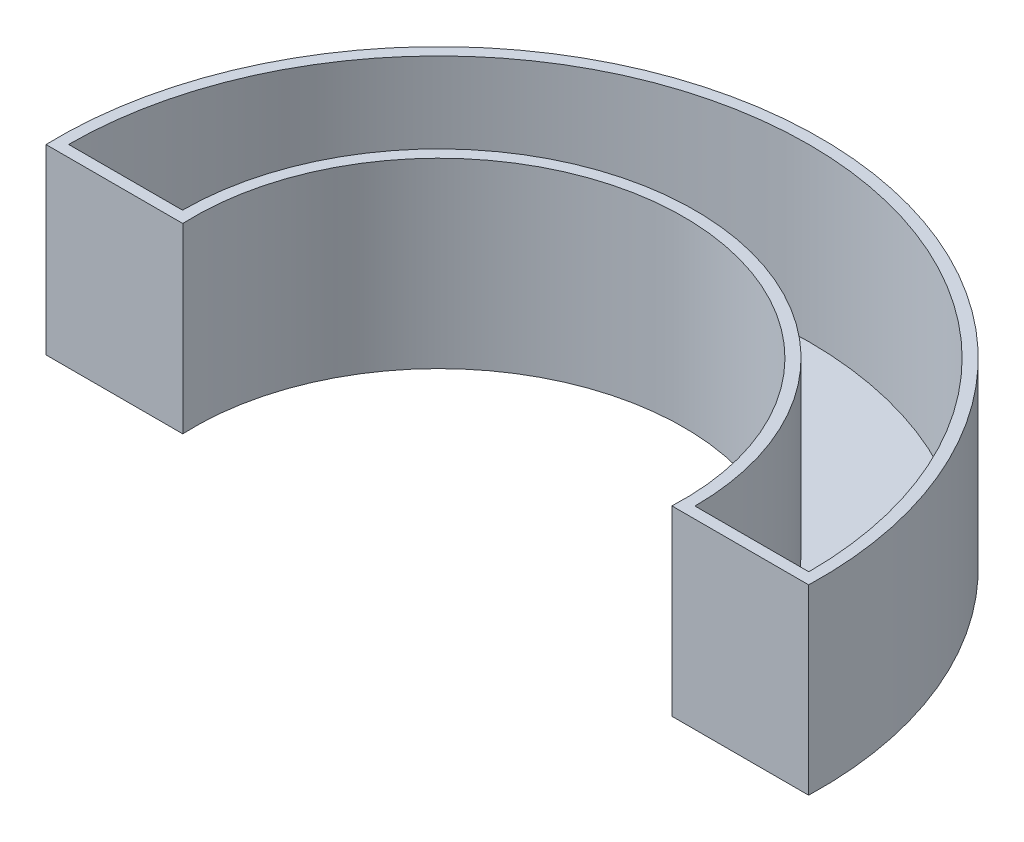
ISO-10303-21;
HEADER;
FILE_DESCRIPTION(('STEP AP214'),'2;1');
FILE_NAME('part.step','',(''),(''),'','','');
FILE_SCHEMA(('AUTOMOTIVE_DESIGN { 1 0 10303 214 1 1 1 1 }'));
ENDSEC;
DATA;
#1=APPLICATION_CONTEXT('core data for automotive mechanical design processes');
#2=APPLICATION_PROTOCOL_DEFINITION('international standard','automotive_design',2000,#1);
#3=PRODUCT_CONTEXT('',#1,'mechanical');
#4=PRODUCT('Part','Part','',(#3));
#5=PRODUCT_RELATED_PRODUCT_CATEGORY('part','',(#4));
#6=PRODUCT_DEFINITION_FORMATION('','',#4);
#7=PRODUCT_DEFINITION_CONTEXT('part definition',#1,'design');
#8=PRODUCT_DEFINITION('design','',#6,#7);
#9=PRODUCT_DEFINITION_SHAPE('','',#8);
#10=(LENGTH_UNIT() NAMED_UNIT(*) SI_UNIT(.MILLI.,.METRE.));
#11=(NAMED_UNIT(*) PLANE_ANGLE_UNIT() SI_UNIT($,.RADIAN.));
#12=(NAMED_UNIT(*) SI_UNIT($,.STERADIAN.) SOLID_ANGLE_UNIT());
#13=UNCERTAINTY_MEASURE_WITH_UNIT(LENGTH_MEASURE(1.E-05),#10,'distance_accuracy_value','');
#14=(GEOMETRIC_REPRESENTATION_CONTEXT(3) GLOBAL_UNCERTAINTY_ASSIGNED_CONTEXT((#13)) GLOBAL_UNIT_ASSIGNED_CONTEXT((#10,
#11,#12)) REPRESENTATION_CONTEXT('',''));
#15=CARTESIAN_POINT('',(0.,0.,0.));
#16=DIRECTION('',(0.,0.,1.));
#17=DIRECTION('',(1.,0.,0.));
#18=AXIS2_PLACEMENT_3D('',#15,#16,#17);
#19=CARTESIAN_POINT('',(0.,6.,0.));
#20=DIRECTION('',(0.,1.,0.));
#21=DIRECTION('',(0.,0.,1.));
#22=AXIS2_PLACEMENT_3D('',#19,#20,#21);
#23=PLANE('',#22);
#24=CARTESIAN_POINT('',(0.,6.,0.));
#25=DIRECTION('',(0.,-1.,0.));
#26=DIRECTION('',(0.,0.,1.));
#27=AXIS2_PLACEMENT_3D('',#24,#25,#26);
#28=CIRCLE('',#27,8.6);
#29=CARTESIAN_POINT('',(-8.59069263796581,6.,0.4));
#30=VERTEX_POINT('',#29);
#31=CARTESIAN_POINT('',(8.59069263796581,6.,0.4));
#32=VERTEX_POINT('',#31);
#33=EDGE_CURVE('E110',#30,#32,#28,.T.);
#34=ORIENTED_EDGE('',*,*,#33,.T.);
#35=DIRECTION('',(1.,0.,0.));
#36=VECTOR('',#35,1.);
#37=CARTESIAN_POINT('',(8.59069263796581,6.,0.4));
#38=LINE('',#37,#36);
#39=CARTESIAN_POINT('',(13.3940285202026,6.,0.4));
#40=VERTEX_POINT('',#39);
#41=EDGE_CURVE('E178',#32,#40,#38,.T.);
#42=ORIENTED_EDGE('',*,*,#41,.T.);
#43=CARTESIAN_POINT('',(0.,6.,0.));
#44=DIRECTION('',(0.,1.,0.));
#45=DIRECTION('',(0.,0.,1.));
#46=AXIS2_PLACEMENT_3D('',#43,#44,#45);
#47=CIRCLE('',#46,13.4);
#48=CARTESIAN_POINT('',(-13.3940285202026,6.,0.399999999999993));
#49=VERTEX_POINT('',#48);
#50=EDGE_CURVE('E181',#40,#49,#47,.T.);
#51=ORIENTED_EDGE('',*,*,#50,.T.);
#52=DIRECTION('',(1.,0.,0.));
#53=VECTOR('',#52,1.);
#54=CARTESIAN_POINT('',(-13.3940285202026,6.,0.399999999999999));
#55=LINE('',#54,#53);
#56=EDGE_CURVE('E63',#49,#30,#55,.T.);
#57=ORIENTED_EDGE('',*,*,#56,.T.);
#58=EDGE_LOOP('',(#34,#42,#51,#57));
#59=FACE_BOUND('',#58,.T.);
#60=DIRECTION('',(1.,0.,0.));
#61=VECTOR('',#60,1.);
#62=CARTESIAN_POINT('',(9.,6.,0.));
#63=LINE('',#62,#61);
#64=CARTESIAN_POINT('',(9.,6.,0.));
#65=VERTEX_POINT('',#64);
#66=CARTESIAN_POINT('',(13.,6.,0.));
#67=VERTEX_POINT('',#66);
#68=EDGE_CURVE('E140',#65,#67,#63,.T.);
#69=ORIENTED_EDGE('',*,*,#68,.F.);
#70=CARTESIAN_POINT('',(0.,6.,0.));
#71=DIRECTION('',(0.,-1.,0.));
#72=DIRECTION('',(0.,0.,1.));
#73=AXIS2_PLACEMENT_3D('',#70,#71,#72);
#74=CIRCLE('',#73,9.);
#75=CARTESIAN_POINT('',(-9.,6.,0.));
#76=VERTEX_POINT('',#75);
#77=EDGE_CURVE('E137',#76,#65,#74,.T.);
#78=ORIENTED_EDGE('',*,*,#77,.F.);
#79=DIRECTION('',(1.,0.,0.));
#80=VECTOR('',#79,1.);
#81=CARTESIAN_POINT('',(-13.,6.,0.));
#82=LINE('',#81,#80);
#83=CARTESIAN_POINT('',(-13.,6.,0.));
#84=VERTEX_POINT('',#83);
#85=EDGE_CURVE('E147',#84,#76,#82,.T.);
#86=ORIENTED_EDGE('',*,*,#85,.F.);
#87=CARTESIAN_POINT('',(0.,6.,0.));
#88=DIRECTION('',(0.,1.,0.));
#89=DIRECTION('',(0.,0.,1.));
#90=AXIS2_PLACEMENT_3D('',#87,#88,#89);
#91=CIRCLE('',#90,13.);
#92=EDGE_CURVE('E144',#67,#84,#91,.T.);
#93=ORIENTED_EDGE('',*,*,#92,.F.);
#94=EDGE_LOOP('',(#69,#78,#86,#93));
#95=FACE_BOUND('',#94,.T.);
#96=ADVANCED_FACE('F39',(#59,#95),#23,.T.);
#97=CARTESIAN_POINT('',(0.,6.,0.));
#98=DIRECTION('',(0.,-1.,0.));
#99=DIRECTION('',(0.,0.,-1.));
#100=AXIS2_PLACEMENT_3D('',#97,#98,#99);
#101=CYLINDRICAL_SURFACE('',#100,8.6);
#102=DIRECTION('',(0.,-1.,0.));
#103=VECTOR('',#102,1.);
#104=CARTESIAN_POINT('',(-8.59069263796581,6.,0.4));
#105=LINE('',#104,#103);
#106=CARTESIAN_POINT('',(-8.59069263796581,-0.4,0.4));
#107=VERTEX_POINT('',#106);
#108=EDGE_CURVE('E105',#30,#107,#105,.T.);
#109=ORIENTED_EDGE('',*,*,#108,.T.);
#110=CARTESIAN_POINT('',(0.,-0.4,0.));
#111=DIRECTION('',(0.,1.,0.));
#112=DIRECTION('',(0.,0.,-1.));
#113=AXIS2_PLACEMENT_3D('',#110,#111,#112);
#114=CIRCLE('',#113,8.6);
#115=CARTESIAN_POINT('',(8.59069263796581,-0.4,0.4));
#116=VERTEX_POINT('',#115);
#117=EDGE_CURVE('E109',#116,#107,#114,.T.);
#118=ORIENTED_EDGE('',*,*,#117,.F.);
#119=DIRECTION('',(0.,-1.,0.));
#120=VECTOR('',#119,1.);
#121=CARTESIAN_POINT('',(8.59069263796581,6.,0.4));
#122=LINE('',#121,#120);
#123=EDGE_CURVE('E11',#32,#116,#122,.T.);
#124=ORIENTED_EDGE('',*,*,#123,.F.);
#125=ORIENTED_EDGE('',*,*,#33,.F.);
#126=EDGE_LOOP('',(#109,#118,#124,#125));
#127=FACE_BOUND('',#126,.T.);
#128=ADVANCED_FACE('F41',(#127),#101,.F.);
#129=CARTESIAN_POINT('',(8.59069263796581,6.,0.4));
#130=DIRECTION('',(0.,0.,-1.));
#131=DIRECTION('',(-1.,0.,0.));
#132=AXIS2_PLACEMENT_3D('',#129,#130,#131);
#133=PLANE('',#132);
#134=ORIENTED_EDGE('',*,*,#123,.T.);
#135=DIRECTION('',(-1.,0.,0.));
#136=VECTOR('',#135,1.);
#137=CARTESIAN_POINT('',(8.59069263796581,-0.4,0.4));
#138=LINE('',#137,#136);
#139=CARTESIAN_POINT('',(13.3940285202026,-0.4,0.4));
#140=VERTEX_POINT('',#139);
#141=EDGE_CURVE('E128',#140,#116,#138,.T.);
#142=ORIENTED_EDGE('',*,*,#141,.F.);
#143=DIRECTION('',(0.,-1.,0.));
#144=VECTOR('',#143,1.);
#145=CARTESIAN_POINT('',(13.3940285202026,6.,0.4));
#146=LINE('',#145,#144);
#147=EDGE_CURVE('E48',#40,#140,#146,.T.);
#148=ORIENTED_EDGE('',*,*,#147,.F.);
#149=ORIENTED_EDGE('',*,*,#41,.F.);
#150=EDGE_LOOP('',(#134,#142,#148,#149));
#151=FACE_BOUND('',#150,.T.);
#152=ADVANCED_FACE('F193',(#151),#133,.F.);
#153=CARTESIAN_POINT('',(0.,6.,0.));
#154=DIRECTION('',(0.,-1.,0.));
#155=DIRECTION('',(0.,0.,-1.));
#156=AXIS2_PLACEMENT_3D('',#153,#154,#155);
#157=CYLINDRICAL_SURFACE('',#156,13.4);
#158=ORIENTED_EDGE('',*,*,#147,.T.);
#159=CARTESIAN_POINT('',(0.,-0.4,0.));
#160=DIRECTION('',(0.,-1.,0.));
#161=DIRECTION('',(0.,0.,-1.));
#162=AXIS2_PLACEMENT_3D('',#159,#160,#161);
#163=CIRCLE('',#162,13.4);
#164=CARTESIAN_POINT('',(-13.3940285202026,-0.4,0.399999999999998));
#165=VERTEX_POINT('',#164);
#166=EDGE_CURVE('E123',#165,#140,#163,.T.);
#167=ORIENTED_EDGE('',*,*,#166,.F.);
#168=DIRECTION('',(0.,-1.,0.));
#169=VECTOR('',#168,1.);
#170=CARTESIAN_POINT('',(-13.3940285202026,6.,0.399999999999993));
#171=LINE('',#170,#169);
#172=EDGE_CURVE('E113',#49,#165,#171,.T.);
#173=ORIENTED_EDGE('',*,*,#172,.F.);
#174=ORIENTED_EDGE('',*,*,#50,.F.);
#175=EDGE_LOOP('',(#158,#167,#173,#174));
#176=FACE_BOUND('',#175,.T.);
#177=ADVANCED_FACE('F191',(#176),#157,.T.);
#178=CARTESIAN_POINT('',(-13.3940285202026,6.,0.399999999999999));
#179=DIRECTION('',(0.,0.,-1.));
#180=DIRECTION('',(-1.,0.,0.));
#181=AXIS2_PLACEMENT_3D('',#178,#179,#180);
#182=PLANE('',#181);
#183=ORIENTED_EDGE('',*,*,#172,.T.);
#184=DIRECTION('',(-1.,0.,0.));
#185=VECTOR('',#184,1.);
#186=CARTESIAN_POINT('',(-13.3940285202026,-0.4,0.399999999999993));
#187=LINE('',#186,#185);
#188=EDGE_CURVE('E116',#107,#165,#187,.T.);
#189=ORIENTED_EDGE('',*,*,#188,.F.);
#190=ORIENTED_EDGE('',*,*,#108,.F.);
#191=ORIENTED_EDGE('',*,*,#56,.F.);
#192=EDGE_LOOP('',(#183,#189,#190,#191));
#193=FACE_BOUND('',#192,.T.);
#194=ADVANCED_FACE('F117',(#193),#182,.F.);
#195=CARTESIAN_POINT('',(0.,6.,0.));
#196=DIRECTION('',(0.,-1.,0.));
#197=DIRECTION('',(0.,0.,-1.));
#198=AXIS2_PLACEMENT_3D('',#195,#196,#197);
#199=CYLINDRICAL_SURFACE('',#198,9.);
#200=CARTESIAN_POINT('',(0.,0.,0.));
#201=DIRECTION('',(0.,-1.,0.));
#202=DIRECTION('',(0.,0.,1.));
#203=AXIS2_PLACEMENT_3D('',#200,#201,#202);
#204=CIRCLE('',#203,9.);
#205=CARTESIAN_POINT('',(-9.,0.,0.));
#206=VERTEX_POINT('',#205);
#207=CARTESIAN_POINT('',(9.,0.,0.));
#208=VERTEX_POINT('',#207);
#209=EDGE_CURVE('E136',#206,#208,#204,.T.);
#210=ORIENTED_EDGE('',*,*,#209,.F.);
#211=DIRECTION('',(0.,-1.,0.));
#212=VECTOR('',#211,1.);
#213=CARTESIAN_POINT('',(-9.,6.,0.));
#214=LINE('',#213,#212);
#215=EDGE_CURVE('E150',#76,#206,#214,.T.);
#216=ORIENTED_EDGE('',*,*,#215,.F.);
#217=ORIENTED_EDGE('',*,*,#77,.T.);
#218=DIRECTION('',(0.,-1.,0.));
#219=VECTOR('',#218,1.);
#220=CARTESIAN_POINT('',(9.,6.,0.));
#221=LINE('',#220,#219);
#222=EDGE_CURVE('E172',#65,#208,#221,.T.);
#223=ORIENTED_EDGE('',*,*,#222,.T.);
#224=EDGE_LOOP('',(#210,#216,#217,#223));
#225=FACE_BOUND('',#224,.T.);
#226=ADVANCED_FACE('F212',(#225),#199,.T.);
#227=CARTESIAN_POINT('',(9.,6.,0.));
#228=DIRECTION('',(0.,0.,-1.));
#229=DIRECTION('',(-1.,0.,0.));
#230=AXIS2_PLACEMENT_3D('',#227,#228,#229);
#231=PLANE('',#230);
#232=DIRECTION('',(1.,0.,0.));
#233=VECTOR('',#232,1.);
#234=CARTESIAN_POINT('',(9.,0.,0.));
#235=LINE('',#234,#233);
#236=CARTESIAN_POINT('',(13.,0.,0.));
#237=VERTEX_POINT('',#236);
#238=EDGE_CURVE('E154',#208,#237,#235,.T.);
#239=ORIENTED_EDGE('',*,*,#238,.F.);
#240=ORIENTED_EDGE('',*,*,#222,.F.);
#241=ORIENTED_EDGE('',*,*,#68,.T.);
#242=DIRECTION('',(0.,-1.,0.));
#243=VECTOR('',#242,1.);
#244=CARTESIAN_POINT('',(13.,6.,0.));
#245=LINE('',#244,#243);
#246=EDGE_CURVE('E169',#67,#237,#245,.T.);
#247=ORIENTED_EDGE('',*,*,#246,.T.);
#248=EDGE_LOOP('',(#239,#240,#241,#247));
#249=FACE_BOUND('',#248,.T.);
#250=ADVANCED_FACE('F204',(#249),#231,.T.);
#251=CARTESIAN_POINT('',(0.,6.,0.));
#252=DIRECTION('',(0.,-1.,0.));
#253=DIRECTION('',(0.,0.,-1.));
#254=AXIS2_PLACEMENT_3D('',#251,#252,#253);
#255=CYLINDRICAL_SURFACE('',#254,13.);
#256=CARTESIAN_POINT('',(0.,0.,0.));
#257=DIRECTION('',(0.,1.,0.));
#258=DIRECTION('',(0.,0.,1.));
#259=AXIS2_PLACEMENT_3D('',#256,#257,#258);
#260=CIRCLE('',#259,13.);
#261=CARTESIAN_POINT('',(-13.,0.,0.));
#262=VERTEX_POINT('',#261);
#263=EDGE_CURVE('E158',#237,#262,#260,.T.);
#264=ORIENTED_EDGE('',*,*,#263,.F.);
#265=ORIENTED_EDGE('',*,*,#246,.F.);
#266=ORIENTED_EDGE('',*,*,#92,.T.);
#267=DIRECTION('',(0.,-1.,0.));
#268=VECTOR('',#267,1.);
#269=CARTESIAN_POINT('',(-13.,6.,0.));
#270=LINE('',#269,#268);
#271=EDGE_CURVE('E55',#84,#262,#270,.T.);
#272=ORIENTED_EDGE('',*,*,#271,.T.);
#273=EDGE_LOOP('',(#264,#265,#266,#272));
#274=FACE_BOUND('',#273,.T.);
#275=ADVANCED_FACE('F207',(#274),#255,.F.);
#276=CARTESIAN_POINT('',(-13.,6.,0.));
#277=DIRECTION('',(0.,0.,-1.));
#278=DIRECTION('',(-1.,0.,0.));
#279=AXIS2_PLACEMENT_3D('',#276,#277,#278);
#280=PLANE('',#279);
#281=DIRECTION('',(1.,0.,0.));
#282=VECTOR('',#281,1.);
#283=CARTESIAN_POINT('',(-13.,0.,0.));
#284=LINE('',#283,#282);
#285=EDGE_CURVE('E141',#262,#206,#284,.T.);
#286=ORIENTED_EDGE('',*,*,#285,.F.);
#287=ORIENTED_EDGE('',*,*,#271,.F.);
#288=ORIENTED_EDGE('',*,*,#85,.T.);
#289=ORIENTED_EDGE('',*,*,#215,.T.);
#290=EDGE_LOOP('',(#286,#287,#288,#289));
#291=FACE_BOUND('',#290,.T.);
#292=ADVANCED_FACE('F214',(#291),#280,.T.);
#293=CARTESIAN_POINT('',(0.,0.,0.));
#294=DIRECTION('',(0.,-1.,0.));
#295=DIRECTION('',(0.,0.,-1.));
#296=AXIS2_PLACEMENT_3D('',#293,#294,#295);
#297=PLANE('',#296);
#298=ORIENTED_EDGE('',*,*,#285,.T.);
#299=ORIENTED_EDGE('',*,*,#209,.T.);
#300=ORIENTED_EDGE('',*,*,#238,.T.);
#301=ORIENTED_EDGE('',*,*,#263,.T.);
#302=EDGE_LOOP('',(#298,#299,#300,#301));
#303=FACE_BOUND('',#302,.T.);
#304=ADVANCED_FACE('F209',(#303),#297,.F.);
#305=CARTESIAN_POINT('',(0.,-0.4,0.));
#306=DIRECTION('',(0.,-1.,0.));
#307=DIRECTION('',(0.,0.,-1.));
#308=AXIS2_PLACEMENT_3D('',#305,#306,#307);
#309=PLANE('',#308);
#310=ORIENTED_EDGE('',*,*,#117,.T.);
#311=ORIENTED_EDGE('',*,*,#188,.T.);
#312=ORIENTED_EDGE('',*,*,#166,.T.);
#313=ORIENTED_EDGE('',*,*,#141,.T.);
#314=EDGE_LOOP('',(#310,#311,#312,#313));
#315=FACE_BOUND('',#314,.T.);
#316=ADVANCED_FACE('F126',(#315),#309,.T.);
#317=CLOSED_SHELL('',(#96,#128,#152,#177,#194,#226,#250,#275,#292,#304,#316));
#318=MANIFOLD_SOLID_BREP('B2',#317);
#319=ADVANCED_BREP_SHAPE_REPRESENTATION('',(#18,#318),#14);
#320=SHAPE_DEFINITION_REPRESENTATION(#9,#319);
ENDSEC;
END-ISO-10303-21;
